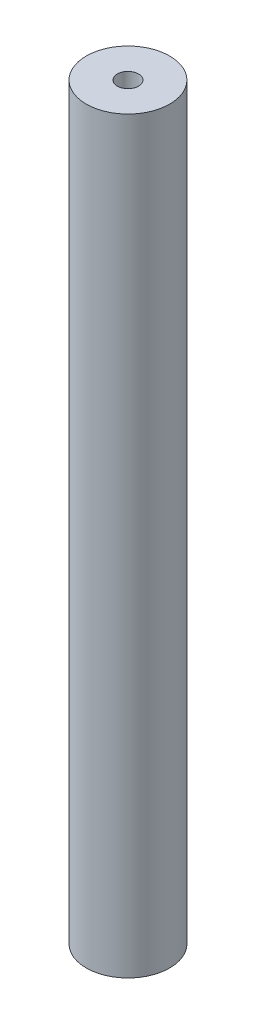
ISO-10303-21;
HEADER;
FILE_DESCRIPTION(('STEP AP214'),'2;1');
FILE_NAME('part.step','',(''),(''),'','','');
FILE_SCHEMA(('AUTOMOTIVE_DESIGN { 1 0 10303 214 1 1 1 1 }'));
ENDSEC;
DATA;
#1=APPLICATION_CONTEXT('core data for automotive mechanical design processes');
#2=APPLICATION_PROTOCOL_DEFINITION('international standard','automotive_design',2000,#1);
#3=PRODUCT_CONTEXT('',#1,'mechanical');
#4=PRODUCT('Part','Part','',(#3));
#5=PRODUCT_RELATED_PRODUCT_CATEGORY('part','',(#4));
#6=PRODUCT_DEFINITION_FORMATION('','',#4);
#7=PRODUCT_DEFINITION_CONTEXT('part definition',#1,'design');
#8=PRODUCT_DEFINITION('design','',#6,#7);
#9=PRODUCT_DEFINITION_SHAPE('','',#8);
#10=(LENGTH_UNIT() NAMED_UNIT(*) SI_UNIT(.MILLI.,.METRE.));
#11=(NAMED_UNIT(*) PLANE_ANGLE_UNIT() SI_UNIT($,.RADIAN.));
#12=(NAMED_UNIT(*) SI_UNIT($,.STERADIAN.) SOLID_ANGLE_UNIT());
#13=UNCERTAINTY_MEASURE_WITH_UNIT(LENGTH_MEASURE(1.E-05),#10,'distance_accuracy_value','');
#14=(GEOMETRIC_REPRESENTATION_CONTEXT(3) GLOBAL_UNCERTAINTY_ASSIGNED_CONTEXT((#13)) GLOBAL_UNIT_ASSIGNED_CONTEXT((#10,
#11,#12)) REPRESENTATION_CONTEXT('',''));
#15=CARTESIAN_POINT('',(0.,0.,0.));
#16=DIRECTION('',(0.,0.,1.));
#17=DIRECTION('',(1.,0.,0.));
#18=AXIS2_PLACEMENT_3D('',#15,#16,#17);
#19=CARTESIAN_POINT('',(0.,79.756,0.));
#20=DIRECTION('',(0.,1.,0.));
#21=DIRECTION('',(0.,0.,1.));
#22=AXIS2_PLACEMENT_3D('',#19,#20,#21);
#23=PLANE('',#22);
#24=CARTESIAN_POINT('',(0.,79.756,0.));
#25=DIRECTION('',(0.,1.,0.));
#26=DIRECTION('',(0.,0.,1.));
#27=AXIS2_PLACEMENT_3D('',#24,#25,#26);
#28=CIRCLE('',#27,4.445);
#29=CARTESIAN_POINT('',(0.,79.756,4.445));
#30=VERTEX_POINT('',#29);
#31=EDGE_CURVE('E10',#30,#30,#28,.T.);
#32=ORIENTED_EDGE('',*,*,#31,.T.);
#33=EDGE_LOOP('',(#32));
#34=FACE_BOUND('',#33,.T.);
#35=CARTESIAN_POINT('',(0.,79.756,0.));
#36=DIRECTION('',(0.,1.,0.));
#37=DIRECTION('',(0.,0.,1.));
#38=AXIS2_PLACEMENT_3D('',#35,#36,#37);
#39=CIRCLE('',#38,1.1303);
#40=CARTESIAN_POINT('',(0.,79.756,1.1303));
#41=VERTEX_POINT('',#40);
#42=EDGE_CURVE('E42',#41,#41,#39,.T.);
#43=ORIENTED_EDGE('',*,*,#42,.F.);
#44=EDGE_LOOP('',(#43));
#45=FACE_BOUND('',#44,.T.);
#46=ADVANCED_FACE('F31',(#34,#45),#23,.T.);
#47=CARTESIAN_POINT('',(0.,0.,0.));
#48=DIRECTION('',(0.,1.,0.));
#49=DIRECTION('',(0.,0.,1.));
#50=AXIS2_PLACEMENT_3D('',#47,#48,#49);
#51=PLANE('',#50);
#52=CARTESIAN_POINT('',(0.,0.,0.));
#53=DIRECTION('',(0.,1.,0.));
#54=DIRECTION('',(0.,0.,1.));
#55=AXIS2_PLACEMENT_3D('',#52,#53,#54);
#56=CIRCLE('',#55,4.445);
#57=CARTESIAN_POINT('',(0.,0.,4.445));
#58=VERTEX_POINT('',#57);
#59=EDGE_CURVE('E35',#58,#58,#56,.T.);
#60=ORIENTED_EDGE('',*,*,#59,.F.);
#61=EDGE_LOOP('',(#60));
#62=FACE_BOUND('',#61,.T.);
#63=CARTESIAN_POINT('',(0.,0.,0.));
#64=DIRECTION('',(0.,1.,0.));
#65=DIRECTION('',(0.,0.,1.));
#66=AXIS2_PLACEMENT_3D('',#63,#64,#65);
#67=CIRCLE('',#66,1.1303);
#68=CARTESIAN_POINT('',(0.,0.,1.1303));
#69=VERTEX_POINT('',#68);
#70=EDGE_CURVE('E44',#69,#69,#67,.T.);
#71=ORIENTED_EDGE('',*,*,#70,.T.);
#72=EDGE_LOOP('',(#71));
#73=FACE_BOUND('',#72,.T.);
#74=ADVANCED_FACE('F54',(#62,#73),#51,.F.);
#75=CARTESIAN_POINT('',(0.,79.756,0.));
#76=DIRECTION('',(0.,-1.,0.));
#77=DIRECTION('',(0.,0.,-1.));
#78=AXIS2_PLACEMENT_3D('',#75,#76,#77);
#79=CYLINDRICAL_SURFACE('',#78,4.445);
#80=ORIENTED_EDGE('',*,*,#31,.F.);
#81=EDGE_LOOP('',(#80));
#82=FACE_BOUND('',#81,.T.);
#83=ORIENTED_EDGE('',*,*,#59,.T.);
#84=EDGE_LOOP('',(#83));
#85=FACE_BOUND('',#84,.T.);
#86=ADVANCED_FACE('F33',(#82,#85),#79,.T.);
#87=CARTESIAN_POINT('',(0.,79.756,0.));
#88=DIRECTION('',(0.,-1.,0.));
#89=DIRECTION('',(0.,0.,-1.));
#90=AXIS2_PLACEMENT_3D('',#87,#88,#89);
#91=CYLINDRICAL_SURFACE('',#90,1.1303);
#92=ORIENTED_EDGE('',*,*,#42,.T.);
#93=EDGE_LOOP('',(#92));
#94=FACE_BOUND('',#93,.T.);
#95=ORIENTED_EDGE('',*,*,#70,.F.);
#96=EDGE_LOOP('',(#95));
#97=FACE_BOUND('',#96,.T.);
#98=ADVANCED_FACE('F50',(#94,#97),#91,.F.);
#99=CLOSED_SHELL('',(#46,#74,#86,#98));
#100=MANIFOLD_SOLID_BREP('B2',#99);
#101=ADVANCED_BREP_SHAPE_REPRESENTATION('',(#18,#100),#14);
#102=SHAPE_DEFINITION_REPRESENTATION(#9,#101);
ENDSEC;
END-ISO-10303-21;
